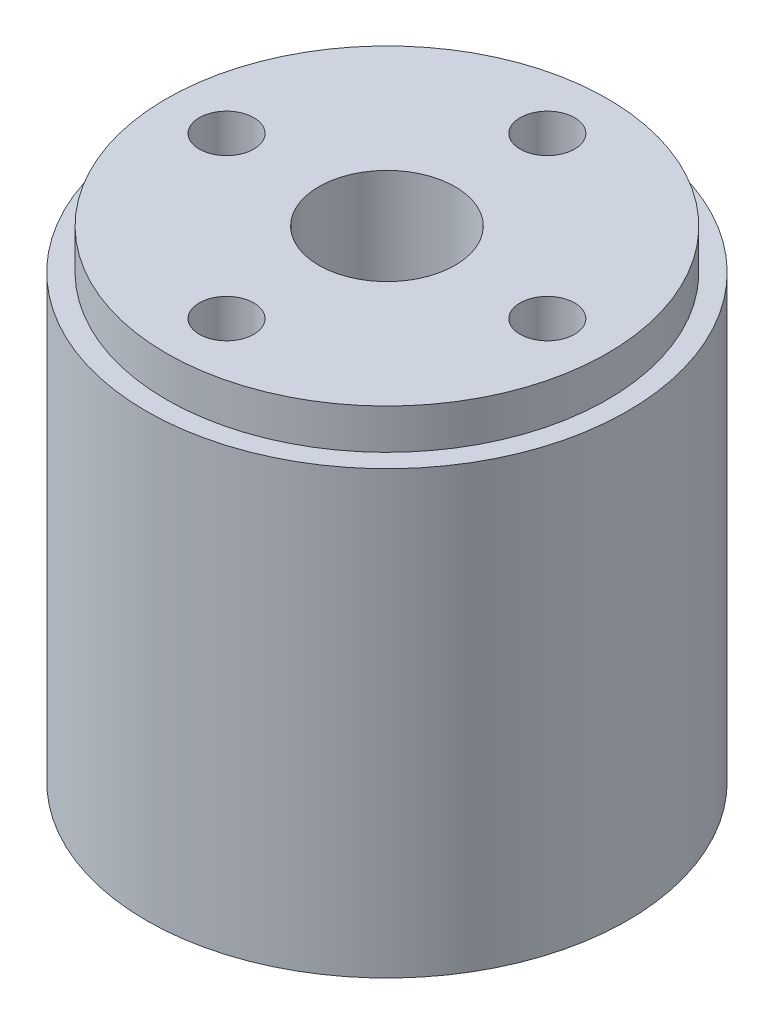
ISO-10303-21;
HEADER;
FILE_DESCRIPTION(('STEP AP214'),'2;1');
FILE_NAME('part.step','',(''),(''),'','','');
FILE_SCHEMA(('AUTOMOTIVE_DESIGN { 1 0 10303 214 1 1 1 1 }'));
ENDSEC;
DATA;
#1=APPLICATION_CONTEXT('core data for automotive mechanical design processes');
#2=APPLICATION_PROTOCOL_DEFINITION('international standard','automotive_design',2000,#1);
#3=PRODUCT_CONTEXT('',#1,'mechanical');
#4=PRODUCT('Part','Part','',(#3));
#5=PRODUCT_RELATED_PRODUCT_CATEGORY('part','',(#4));
#6=PRODUCT_DEFINITION_FORMATION('','',#4);
#7=PRODUCT_DEFINITION_CONTEXT('part definition',#1,'design');
#8=PRODUCT_DEFINITION('design','',#6,#7);
#9=PRODUCT_DEFINITION_SHAPE('','',#8);
#10=(LENGTH_UNIT() NAMED_UNIT(*) SI_UNIT(.MILLI.,.METRE.));
#11=(NAMED_UNIT(*) PLANE_ANGLE_UNIT() SI_UNIT($,.RADIAN.));
#12=(NAMED_UNIT(*) SI_UNIT($,.STERADIAN.) SOLID_ANGLE_UNIT());
#13=UNCERTAINTY_MEASURE_WITH_UNIT(LENGTH_MEASURE(1.E-05),#10,'distance_accuracy_value','');
#14=(GEOMETRIC_REPRESENTATION_CONTEXT(3) GLOBAL_UNCERTAINTY_ASSIGNED_CONTEXT((#13)) GLOBAL_UNIT_ASSIGNED_CONTEXT((#10,
#11,#12)) REPRESENTATION_CONTEXT('',''));
#15=CARTESIAN_POINT('',(0.,0.,0.));
#16=DIRECTION('',(0.,0.,1.));
#17=DIRECTION('',(1.,0.,0.));
#18=AXIS2_PLACEMENT_3D('',#15,#16,#17);
#19=CARTESIAN_POINT('',(0.,60.,0.));
#20=DIRECTION('',(0.,1.,0.));
#21=DIRECTION('',(0.,0.,1.));
#22=AXIS2_PLACEMENT_3D('',#19,#20,#21);
#23=PLANE('',#22);
#24=CARTESIAN_POINT('',(0.,60.,20.));
#25=DIRECTION('',(0.,1.,0.));
#26=DIRECTION('',(0.,0.,1.));
#27=AXIS2_PLACEMENT_3D('',#24,#25,#26);
#28=CIRCLE('',#27,3.40000000000006);
#29=CARTESIAN_POINT('',(0.,60.,23.4000000000001));
#30=VERTEX_POINT('',#29);
#31=EDGE_CURVE('E72',#30,#30,#28,.T.);
#32=ORIENTED_EDGE('',*,*,#31,.F.);
#33=EDGE_LOOP('',(#32));
#34=FACE_BOUND('',#33,.T.);
#35=CARTESIAN_POINT('',(0.,60.,-20.));
#36=DIRECTION('',(0.,1.,0.));
#37=DIRECTION('',(0.,0.,1.));
#38=AXIS2_PLACEMENT_3D('',#35,#36,#37);
#39=CIRCLE('',#38,3.40000000000001);
#40=CARTESIAN_POINT('',(0.,60.,-16.6));
#41=VERTEX_POINT('',#40);
#42=EDGE_CURVE('E60',#41,#41,#39,.T.);
#43=ORIENTED_EDGE('',*,*,#42,.F.);
#44=EDGE_LOOP('',(#43));
#45=FACE_BOUND('',#44,.T.);
#46=CARTESIAN_POINT('',(0.,60.,0.));
#47=DIRECTION('',(0.,1.,0.));
#48=DIRECTION('',(0.,0.,1.));
#49=AXIS2_PLACEMENT_3D('',#46,#47,#48);
#50=CIRCLE('',#49,8.5);
#51=CARTESIAN_POINT('',(0.,60.,8.5));
#52=VERTEX_POINT('',#51);
#53=EDGE_CURVE('E51',#52,#52,#50,.T.);
#54=ORIENTED_EDGE('',*,*,#53,.F.);
#55=EDGE_LOOP('',(#54));
#56=FACE_BOUND('',#55,.T.);
#57=CARTESIAN_POINT('',(-20.,60.,0.));
#58=DIRECTION('',(0.,1.,0.));
#59=DIRECTION('',(0.,0.,1.));
#60=AXIS2_PLACEMENT_3D('',#57,#58,#59);
#61=CIRCLE('',#60,3.4);
#62=CARTESIAN_POINT('',(-20.,60.,3.4));
#63=VERTEX_POINT('',#62);
#64=EDGE_CURVE('E56',#63,#63,#61,.T.);
#65=ORIENTED_EDGE('',*,*,#64,.F.);
#66=EDGE_LOOP('',(#65));
#67=FACE_BOUND('',#66,.T.);
#68=CARTESIAN_POINT('',(20.,60.,1.37209959955431E-13));
#69=DIRECTION('',(0.,1.,0.));
#70=DIRECTION('',(0.,0.,1.));
#71=AXIS2_PLACEMENT_3D('',#68,#69,#70);
#72=CIRCLE('',#71,3.4);
#73=CARTESIAN_POINT('',(20.,60.,3.40000000000014));
#74=VERTEX_POINT('',#73);
#75=EDGE_CURVE('E66',#74,#74,#72,.T.);
#76=ORIENTED_EDGE('',*,*,#75,.F.);
#77=EDGE_LOOP('',(#76));
#78=FACE_BOUND('',#77,.T.);
#79=CARTESIAN_POINT('',(0.,60.,0.));
#80=DIRECTION('',(0.,1.,0.));
#81=DIRECTION('',(0.,0.,1.));
#82=AXIS2_PLACEMENT_3D('',#79,#80,#81);
#83=CIRCLE('',#82,27.5);
#84=CARTESIAN_POINT('',(0.,60.,27.5));
#85=VERTEX_POINT('',#84);
#86=EDGE_CURVE('E84',#85,#85,#83,.T.);
#87=ORIENTED_EDGE('',*,*,#86,.T.);
#88=EDGE_LOOP('',(#87));
#89=FACE_BOUND('',#88,.T.);
#90=ADVANCED_FACE('F35',(#34,#45,#56,#67,#78,#89),#23,.T.);
#91=CARTESIAN_POINT('',(0.,60.,0.));
#92=DIRECTION('',(0.,-1.,0.));
#93=DIRECTION('',(0.,0.,-1.));
#94=AXIS2_PLACEMENT_3D('',#91,#92,#93);
#95=CYLINDRICAL_SURFACE('',#94,30.);
#96=CARTESIAN_POINT('',(0.,0.,0.));
#97=DIRECTION('',(0.,1.,0.));
#98=DIRECTION('',(0.,0.,1.));
#99=AXIS2_PLACEMENT_3D('',#96,#97,#98);
#100=CIRCLE('',#99,30.);
#101=CARTESIAN_POINT('',(0.,0.,30.));
#102=VERTEX_POINT('',#101);
#103=EDGE_CURVE('E47',#102,#102,#100,.T.);
#104=ORIENTED_EDGE('',*,*,#103,.T.);
#105=EDGE_LOOP('',(#104));
#106=FACE_BOUND('',#105,.T.);
#107=CARTESIAN_POINT('',(0.,55.,0.));
#108=DIRECTION('',(0.,1.,0.));
#109=DIRECTION('',(0.,0.,1.));
#110=AXIS2_PLACEMENT_3D('',#107,#108,#109);
#111=CIRCLE('',#110,30.);
#112=CARTESIAN_POINT('',(0.,55.,30.));
#113=VERTEX_POINT('',#112);
#114=EDGE_CURVE('E78',#113,#113,#111,.T.);
#115=ORIENTED_EDGE('',*,*,#114,.F.);
#116=EDGE_LOOP('',(#115));
#117=FACE_BOUND('',#116,.T.);
#118=ADVANCED_FACE('F100',(#106,#117),#95,.T.);
#119=CARTESIAN_POINT('',(0.,0.,0.));
#120=DIRECTION('',(0.,1.,0.));
#121=DIRECTION('',(0.,0.,1.));
#122=AXIS2_PLACEMENT_3D('',#119,#120,#121);
#123=PLANE('',#122);
#124=CARTESIAN_POINT('',(0.,0.,0.));
#125=DIRECTION('',(0.,1.,0.));
#126=DIRECTION('',(0.,0.,1.));
#127=AXIS2_PLACEMENT_3D('',#124,#125,#126);
#128=CIRCLE('',#127,13.5);
#129=CARTESIAN_POINT('',(0.,0.,13.5));
#130=VERTEX_POINT('',#129);
#131=EDGE_CURVE('E43',#130,#130,#128,.T.);
#132=ORIENTED_EDGE('',*,*,#131,.T.);
#133=EDGE_LOOP('',(#132));
#134=FACE_BOUND('',#133,.T.);
#135=ORIENTED_EDGE('',*,*,#103,.F.);
#136=EDGE_LOOP('',(#135));
#137=FACE_BOUND('',#136,.T.);
#138=CARTESIAN_POINT('',(-20.,0.,0.));
#139=DIRECTION('',(0.,1.,0.));
#140=DIRECTION('',(0.,0.,1.));
#141=AXIS2_PLACEMENT_3D('',#138,#139,#140);
#142=CIRCLE('',#141,3.4);
#143=CARTESIAN_POINT('',(-20.,0.,3.4));
#144=VERTEX_POINT('',#143);
#145=EDGE_CURVE('E57',#144,#144,#142,.T.);
#146=ORIENTED_EDGE('',*,*,#145,.T.);
#147=EDGE_LOOP('',(#146));
#148=FACE_BOUND('',#147,.T.);
#149=CARTESIAN_POINT('',(0.,0.,-20.));
#150=DIRECTION('',(0.,1.,0.));
#151=DIRECTION('',(0.,0.,1.));
#152=AXIS2_PLACEMENT_3D('',#149,#150,#151);
#153=CIRCLE('',#152,3.40000000000001);
#154=CARTESIAN_POINT('',(0.,0.,-16.6));
#155=VERTEX_POINT('',#154);
#156=EDGE_CURVE('E63',#155,#155,#153,.T.);
#157=ORIENTED_EDGE('',*,*,#156,.T.);
#158=EDGE_LOOP('',(#157));
#159=FACE_BOUND('',#158,.T.);
#160=CARTESIAN_POINT('',(20.,0.,1.37209959955431E-13));
#161=DIRECTION('',(0.,1.,0.));
#162=DIRECTION('',(0.,0.,1.));
#163=AXIS2_PLACEMENT_3D('',#160,#161,#162);
#164=CIRCLE('',#163,3.4);
#165=CARTESIAN_POINT('',(20.,0.,3.40000000000014));
#166=VERTEX_POINT('',#165);
#167=EDGE_CURVE('E69',#166,#166,#164,.T.);
#168=ORIENTED_EDGE('',*,*,#167,.T.);
#169=EDGE_LOOP('',(#168));
#170=FACE_BOUND('',#169,.T.);
#171=CARTESIAN_POINT('',(0.,0.,20.));
#172=DIRECTION('',(0.,1.,0.));
#173=DIRECTION('',(0.,0.,1.));
#174=AXIS2_PLACEMENT_3D('',#171,#172,#173);
#175=CIRCLE('',#174,3.40000000000006);
#176=CARTESIAN_POINT('',(0.,0.,23.4000000000001));
#177=VERTEX_POINT('',#176);
#178=EDGE_CURVE('E75',#177,#177,#175,.T.);
#179=ORIENTED_EDGE('',*,*,#178,.T.);
#180=EDGE_LOOP('',(#179));
#181=FACE_BOUND('',#180,.T.);
#182=ADVANCED_FACE('F102',(#134,#137,#148,#159,#170,#181),#123,.F.);
#183=CARTESIAN_POINT('',(0.,60.,0.));
#184=DIRECTION('',(0.,-1.,0.));
#185=DIRECTION('',(0.,0.,-1.));
#186=AXIS2_PLACEMENT_3D('',#183,#184,#185);
#187=CYLINDRICAL_SURFACE('',#186,8.5);
#188=CARTESIAN_POINT('',(0.,5.00000000000004,0.));
#189=DIRECTION('',(0.,1.,0.));
#190=DIRECTION('',(0.,0.,1.));
#191=AXIS2_PLACEMENT_3D('',#188,#189,#190);
#192=CIRCLE('',#191,8.5);
#193=CARTESIAN_POINT('',(0.,5.00000000000004,8.5));
#194=VERTEX_POINT('',#193);
#195=EDGE_CURVE('E10',#194,#194,#192,.F.);
#196=ORIENTED_EDGE('',*,*,#195,.T.);
#197=EDGE_LOOP('',(#196));
#198=FACE_BOUND('',#197,.T.);
#199=ORIENTED_EDGE('',*,*,#53,.T.);
#200=EDGE_LOOP('',(#199));
#201=FACE_BOUND('',#200,.T.);
#202=ADVANCED_FACE('F108',(#198,#201),#187,.F.);
#203=CARTESIAN_POINT('',(-20.,60.,0.));
#204=DIRECTION('',(0.,-1.,0.));
#205=DIRECTION('',(0.,0.,-1.));
#206=AXIS2_PLACEMENT_3D('',#203,#204,#205);
#207=CYLINDRICAL_SURFACE('',#206,3.4);
#208=ORIENTED_EDGE('',*,*,#64,.T.);
#209=EDGE_LOOP('',(#208));
#210=FACE_BOUND('',#209,.T.);
#211=ORIENTED_EDGE('',*,*,#145,.F.);
#212=EDGE_LOOP('',(#211));
#213=FACE_BOUND('',#212,.T.);
#214=ADVANCED_FACE('F115',(#210,#213),#207,.F.);
#215=CARTESIAN_POINT('',(0.,60.,-20.));
#216=DIRECTION('',(0.,-1.,0.));
#217=DIRECTION('',(0.,0.,-1.));
#218=AXIS2_PLACEMENT_3D('',#215,#216,#217);
#219=CYLINDRICAL_SURFACE('',#218,3.40000000000001);
#220=ORIENTED_EDGE('',*,*,#42,.T.);
#221=EDGE_LOOP('',(#220));
#222=FACE_BOUND('',#221,.T.);
#223=ORIENTED_EDGE('',*,*,#156,.F.);
#224=EDGE_LOOP('',(#223));
#225=FACE_BOUND('',#224,.T.);
#226=ADVANCED_FACE('F118',(#222,#225),#219,.F.);
#227=CARTESIAN_POINT('',(20.,60.,1.37209959955431E-13));
#228=DIRECTION('',(0.,-1.,0.));
#229=DIRECTION('',(0.,0.,-1.));
#230=AXIS2_PLACEMENT_3D('',#227,#228,#229);
#231=CYLINDRICAL_SURFACE('',#230,3.4);
#232=ORIENTED_EDGE('',*,*,#75,.T.);
#233=EDGE_LOOP('',(#232));
#234=FACE_BOUND('',#233,.T.);
#235=ORIENTED_EDGE('',*,*,#167,.F.);
#236=EDGE_LOOP('',(#235));
#237=FACE_BOUND('',#236,.T.);
#238=ADVANCED_FACE('F122',(#234,#237),#231,.F.);
#239=CARTESIAN_POINT('',(0.,60.,20.));
#240=DIRECTION('',(0.,-1.,0.));
#241=DIRECTION('',(0.,0.,-1.));
#242=AXIS2_PLACEMENT_3D('',#239,#240,#241);
#243=CYLINDRICAL_SURFACE('',#242,3.40000000000006);
#244=ORIENTED_EDGE('',*,*,#31,.T.);
#245=EDGE_LOOP('',(#244));
#246=FACE_BOUND('',#245,.T.);
#247=ORIENTED_EDGE('',*,*,#178,.F.);
#248=EDGE_LOOP('',(#247));
#249=FACE_BOUND('',#248,.T.);
#250=ADVANCED_FACE('F96',(#246,#249),#243,.F.);
#251=CARTESIAN_POINT('',(0.,55.,0.));
#252=DIRECTION('',(0.,1.,0.));
#253=DIRECTION('',(0.,0.,1.));
#254=AXIS2_PLACEMENT_3D('',#251,#252,#253);
#255=PLANE('',#254);
#256=CARTESIAN_POINT('',(0.,55.,0.));
#257=DIRECTION('',(0.,1.,0.));
#258=DIRECTION('',(0.,0.,1.));
#259=AXIS2_PLACEMENT_3D('',#256,#257,#258);
#260=CIRCLE('',#259,27.5);
#261=CARTESIAN_POINT('',(0.,55.,27.5));
#262=VERTEX_POINT('',#261);
#263=EDGE_CURVE('E83',#262,#262,#260,.T.);
#264=ORIENTED_EDGE('',*,*,#263,.F.);
#265=EDGE_LOOP('',(#264));
#266=FACE_BOUND('',#265,.T.);
#267=ORIENTED_EDGE('',*,*,#114,.T.);
#268=EDGE_LOOP('',(#267));
#269=FACE_BOUND('',#268,.T.);
#270=ADVANCED_FACE('F93',(#266,#269),#255,.T.);
#271=CARTESIAN_POINT('',(0.,55.,0.));
#272=DIRECTION('',(0.,1.,0.));
#273=DIRECTION('',(0.,0.,1.));
#274=AXIS2_PLACEMENT_3D('',#271,#272,#273);
#275=CYLINDRICAL_SURFACE('',#274,27.5);
#276=ORIENTED_EDGE('',*,*,#263,.T.);
#277=EDGE_LOOP('',(#276));
#278=FACE_BOUND('',#277,.T.);
#279=ORIENTED_EDGE('',*,*,#86,.F.);
#280=EDGE_LOOP('',(#279));
#281=FACE_BOUND('',#280,.T.);
#282=ADVANCED_FACE('F90',(#278,#281),#275,.T.);
#283=CARTESIAN_POINT('',(0.,0.,0.));
#284=DIRECTION('',(0.,-1.,0.));
#285=DIRECTION('',(0.,0.,-1.));
#286=AXIS2_PLACEMENT_3D('',#283,#284,#285);
#287=CONICAL_SURFACE('',#286,13.5,0.785398163397446);
#288=ORIENTED_EDGE('',*,*,#195,.F.);
#289=EDGE_LOOP('',(#288));
#290=FACE_BOUND('',#289,.T.);
#291=ORIENTED_EDGE('',*,*,#131,.F.);
#292=EDGE_LOOP('',(#291));
#293=FACE_BOUND('',#292,.T.);
#294=ADVANCED_FACE('F38',(#290,#293),#287,.F.);
#295=CLOSED_SHELL('',(#90,#118,#182,#202,#214,#226,#238,#250,#270,#282,#294));
#296=MANIFOLD_SOLID_BREP('B2',#295);
#297=ADVANCED_BREP_SHAPE_REPRESENTATION('',(#18,#296),#14);
#298=SHAPE_DEFINITION_REPRESENTATION(#9,#297);
ENDSEC;
END-ISO-10303-21;
